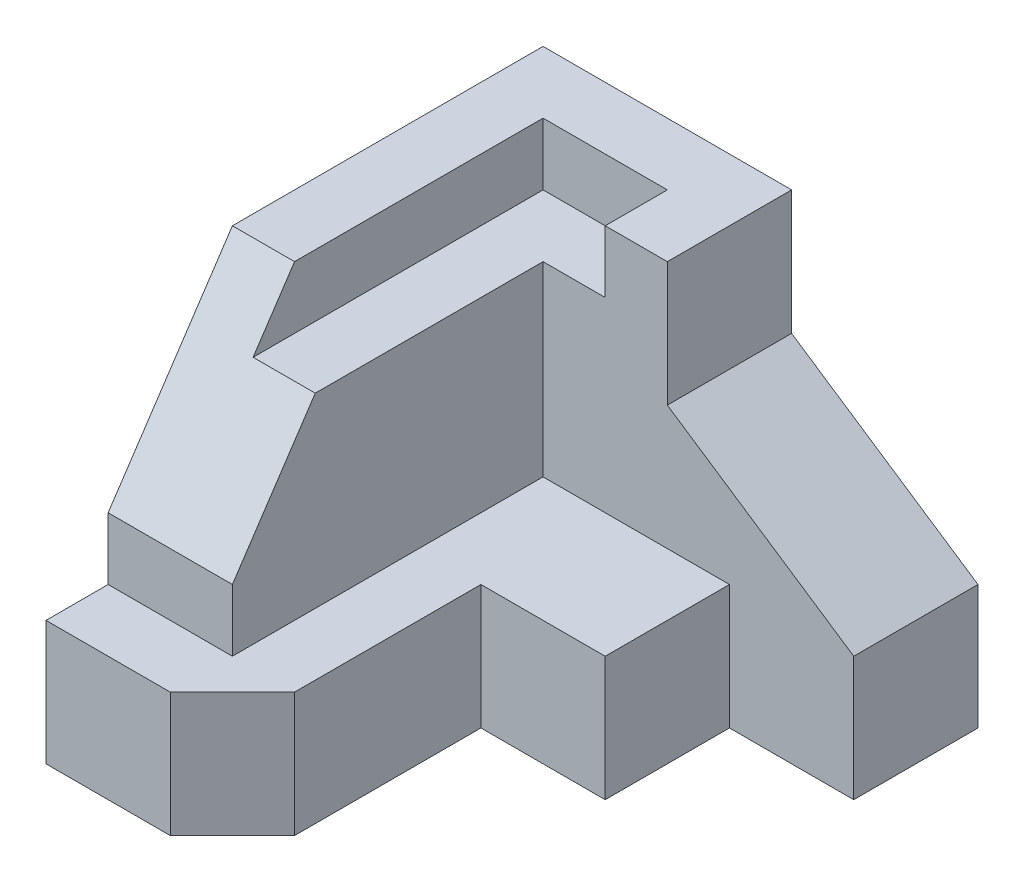
ISO-10303-21;
HEADER;
FILE_DESCRIPTION(('STEP AP214'),'2;1');
FILE_NAME('part.step','',(''),(''),'','','');
FILE_SCHEMA(('AUTOMOTIVE_DESIGN { 1 0 10303 214 1 1 1 1 }'));
ENDSEC;
DATA;
#1=APPLICATION_CONTEXT('core data for automotive mechanical design processes');
#2=APPLICATION_PROTOCOL_DEFINITION('international standard','automotive_design',2000,#1);
#3=PRODUCT_CONTEXT('',#1,'mechanical');
#4=PRODUCT('Part','Part','',(#3));
#5=PRODUCT_RELATED_PRODUCT_CATEGORY('part','',(#4));
#6=PRODUCT_DEFINITION_FORMATION('','',#4);
#7=PRODUCT_DEFINITION_CONTEXT('part definition',#1,'design');
#8=PRODUCT_DEFINITION('design','',#6,#7);
#9=PRODUCT_DEFINITION_SHAPE('','',#8);
#10=(LENGTH_UNIT() NAMED_UNIT(*) SI_UNIT(.MILLI.,.METRE.));
#11=(NAMED_UNIT(*) PLANE_ANGLE_UNIT() SI_UNIT($,.RADIAN.));
#12=(NAMED_UNIT(*) SI_UNIT($,.STERADIAN.) SOLID_ANGLE_UNIT());
#13=UNCERTAINTY_MEASURE_WITH_UNIT(LENGTH_MEASURE(1.E-05),#10,'distance_accuracy_value','');
#14=(GEOMETRIC_REPRESENTATION_CONTEXT(3) GLOBAL_UNCERTAINTY_ASSIGNED_CONTEXT((#13)) GLOBAL_UNIT_ASSIGNED_CONTEXT((#10,
#11,#12)) REPRESENTATION_CONTEXT('',''));
#15=CARTESIAN_POINT('',(0.,0.,0.));
#16=DIRECTION('',(0.,0.,1.));
#17=DIRECTION('',(1.,0.,0.));
#18=AXIS2_PLACEMENT_3D('',#15,#16,#17);
#19=CARTESIAN_POINT('',(0.,0.,8.));
#20=DIRECTION('',(0.,0.,1.));
#21=DIRECTION('',(1.,0.,0.));
#22=AXIS2_PLACEMENT_3D('',#19,#20,#21);
#23=PLANE('',#22);
#24=DIRECTION('',(0.,1.,0.));
#25=VECTOR('',#24,1.);
#26=CARTESIAN_POINT('',(-1.5,-3.,8.));
#27=LINE('',#26,#25);
#28=CARTESIAN_POINT('',(-1.5,-3.,8.));
#29=VERTEX_POINT('',#28);
#30=CARTESIAN_POINT('',(-1.5,-0.999999999999999,8.));
#31=VERTEX_POINT('',#30);
#32=EDGE_CURVE('E209',#29,#31,#27,.T.);
#33=ORIENTED_EDGE('',*,*,#32,.T.);
#34=DIRECTION('',(1.,0.,0.));
#35=VECTOR('',#34,1.);
#36=CARTESIAN_POINT('',(-3.5,-1.,8.));
#37=LINE('',#36,#35);
#38=CARTESIAN_POINT('',(-3.5,-1.,8.));
#39=VERTEX_POINT('',#38);
#40=EDGE_CURVE('E264',#39,#31,#37,.T.);
#41=ORIENTED_EDGE('',*,*,#40,.F.);
#42=DIRECTION('',(0.,-1.,0.));
#43=VECTOR('',#42,1.);
#44=CARTESIAN_POINT('',(-3.5,-3.,8.));
#45=LINE('',#44,#43);
#46=CARTESIAN_POINT('',(-3.5,-3.,8.));
#47=VERTEX_POINT('',#46);
#48=EDGE_CURVE('E191',#39,#47,#45,.T.);
#49=ORIENTED_EDGE('',*,*,#48,.T.);
#50=DIRECTION('',(1.,0.,0.));
#51=VECTOR('',#50,1.);
#52=CARTESIAN_POINT('',(3.5,-3.,8.));
#53=LINE('',#52,#51);
#54=EDGE_CURVE('E187',#47,#29,#53,.T.);
#55=ORIENTED_EDGE('',*,*,#54,.T.);
#56=EDGE_LOOP('',(#33,#41,#49,#55));
#57=FACE_BOUND('',#56,.T.);
#58=ADVANCED_FACE('F33',(#57),#23,.T.);
#59=CARTESIAN_POINT('',(-0.499999999999998,-3.,7.));
#60=DIRECTION('',(-0.707106781186547,0.,-0.707106781186548));
#61=DIRECTION('',(-0.707106781186548,0.,0.707106781186547));
#62=AXIS2_PLACEMENT_3D('',#59,#60,#61);
#63=PLANE('',#62);
#64=DIRECTION('',(0.707106781186548,0.,-0.707106781186547));
#65=VECTOR('',#64,1.);
#66=CARTESIAN_POINT('',(-1.5,-0.999999999999999,8.));
#67=LINE('',#66,#65);
#68=CARTESIAN_POINT('',(-0.499999999999998,-0.999999999999999,7.));
#69=VERTEX_POINT('',#68);
#70=EDGE_CURVE('E262',#31,#69,#67,.T.);
#71=ORIENTED_EDGE('',*,*,#70,.F.);
#72=ORIENTED_EDGE('',*,*,#32,.F.);
#73=DIRECTION('',(-0.707106781186548,0.,0.707106781186547));
#74=VECTOR('',#73,1.);
#75=CARTESIAN_POINT('',(-0.499999999999998,-3.,7.));
#76=LINE('',#75,#74);
#77=CARTESIAN_POINT('',(-0.499999999999998,-3.,7.));
#78=VERTEX_POINT('',#77);
#79=EDGE_CURVE('E227',#78,#29,#76,.T.);
#80=ORIENTED_EDGE('',*,*,#79,.F.);
#81=DIRECTION('',(0.,1.,0.));
#82=VECTOR('',#81,1.);
#83=CARTESIAN_POINT('',(-0.499999999999998,-3.,7.));
#84=LINE('',#83,#82);
#85=EDGE_CURVE('E214',#78,#69,#84,.T.);
#86=ORIENTED_EDGE('',*,*,#85,.T.);
#87=EDGE_LOOP('',(#71,#72,#80,#86));
#88=FACE_BOUND('',#87,.T.);
#89=ADVANCED_FACE('F364',(#88),#63,.F.);
#90=CARTESIAN_POINT('',(-0.499999999999999,-3.,4.));
#91=DIRECTION('',(-1.,0.,0.));
#92=DIRECTION('',(0.,-1.,0.));
#93=AXIS2_PLACEMENT_3D('',#90,#91,#92);
#94=PLANE('',#93);
#95=DIRECTION('',(0.,0.,-1.));
#96=VECTOR('',#95,1.);
#97=CARTESIAN_POINT('',(-0.499999999999998,-0.999999999999999,7.));
#98=LINE('',#97,#96);
#99=CARTESIAN_POINT('',(-0.499999999999999,-0.999999999999999,4.));
#100=VERTEX_POINT('',#99);
#101=EDGE_CURVE('E257',#69,#100,#98,.T.);
#102=ORIENTED_EDGE('',*,*,#101,.F.);
#103=ORIENTED_EDGE('',*,*,#85,.F.);
#104=DIRECTION('',(0.,0.,1.));
#105=VECTOR('',#104,1.);
#106=CARTESIAN_POINT('',(-0.499999999999999,-3.,4.));
#107=LINE('',#106,#105);
#108=CARTESIAN_POINT('',(-0.499999999999999,-3.,4.));
#109=VERTEX_POINT('',#108);
#110=EDGE_CURVE('E243',#109,#78,#107,.T.);
#111=ORIENTED_EDGE('',*,*,#110,.F.);
#112=DIRECTION('',(0.,1.,0.));
#113=VECTOR('',#112,1.);
#114=CARTESIAN_POINT('',(-0.499999999999999,-3.,4.));
#115=LINE('',#114,#113);
#116=EDGE_CURVE('E233',#109,#100,#115,.T.);
#117=ORIENTED_EDGE('',*,*,#116,.T.);
#118=EDGE_LOOP('',(#102,#103,#111,#117));
#119=FACE_BOUND('',#118,.T.);
#120=ADVANCED_FACE('F369',(#119),#94,.F.);
#121=CARTESIAN_POINT('',(1.5,-3.,4.));
#122=DIRECTION('',(0.,0.,-1.));
#123=DIRECTION('',(-1.,0.,0.));
#124=AXIS2_PLACEMENT_3D('',#121,#122,#123);
#125=PLANE('',#124);
#126=DIRECTION('',(1.,0.,0.));
#127=VECTOR('',#126,1.);
#128=CARTESIAN_POINT('',(-0.499999999999999,-0.999999999999999,4.));
#129=LINE('',#128,#127);
#130=CARTESIAN_POINT('',(1.5,-0.999999999999999,4.));
#131=VERTEX_POINT('',#130);
#132=EDGE_CURVE('E279',#100,#131,#129,.T.);
#133=ORIENTED_EDGE('',*,*,#132,.F.);
#134=ORIENTED_EDGE('',*,*,#116,.F.);
#135=DIRECTION('',(-1.,0.,0.));
#136=VECTOR('',#135,1.);
#137=CARTESIAN_POINT('',(1.5,-3.,4.));
#138=LINE('',#137,#136);
#139=CARTESIAN_POINT('',(1.5,-3.,4.));
#140=VERTEX_POINT('',#139);
#141=EDGE_CURVE('E245',#140,#109,#138,.T.);
#142=ORIENTED_EDGE('',*,*,#141,.F.);
#143=DIRECTION('',(0.,1.,0.));
#144=VECTOR('',#143,1.);
#145=CARTESIAN_POINT('',(1.5,-3.,4.));
#146=LINE('',#145,#144);
#147=EDGE_CURVE('E230',#140,#131,#146,.T.);
#148=ORIENTED_EDGE('',*,*,#147,.T.);
#149=EDGE_LOOP('',(#133,#134,#142,#148));
#150=FACE_BOUND('',#149,.T.);
#151=ADVANCED_FACE('F390',(#150),#125,.F.);
#152=CARTESIAN_POINT('',(1.5,-3.,2.));
#153=DIRECTION('',(-1.,0.,0.));
#154=DIRECTION('',(0.,-1.,0.));
#155=AXIS2_PLACEMENT_3D('',#152,#153,#154);
#156=PLANE('',#155);
#157=DIRECTION('',(0.,0.,-1.));
#158=VECTOR('',#157,1.);
#159=CARTESIAN_POINT('',(1.5,-0.999999999999999,4.));
#160=LINE('',#159,#158);
#161=CARTESIAN_POINT('',(1.5,-1.,2.));
#162=VERTEX_POINT('',#161);
#163=EDGE_CURVE('E277',#131,#162,#160,.T.);
#164=ORIENTED_EDGE('',*,*,#163,.F.);
#165=ORIENTED_EDGE('',*,*,#147,.F.);
#166=DIRECTION('',(0.,0.,1.));
#167=VECTOR('',#166,1.);
#168=CARTESIAN_POINT('',(1.5,-3.,2.));
#169=LINE('',#168,#167);
#170=CARTESIAN_POINT('',(1.5,-3.,2.));
#171=VERTEX_POINT('',#170);
#172=EDGE_CURVE('E248',#171,#140,#169,.T.);
#173=ORIENTED_EDGE('',*,*,#172,.F.);
#174=DIRECTION('',(0.,1.,0.));
#175=VECTOR('',#174,1.);
#176=CARTESIAN_POINT('',(1.5,-3.,2.));
#177=LINE('',#176,#175);
#178=EDGE_CURVE('E226',#171,#162,#177,.T.);
#179=ORIENTED_EDGE('',*,*,#178,.T.);
#180=EDGE_LOOP('',(#164,#165,#173,#179));
#181=FACE_BOUND('',#180,.T.);
#182=ADVANCED_FACE('F386',(#181),#156,.F.);
#183=CARTESIAN_POINT('',(-3.5,-3.,8.));
#184=DIRECTION('',(1.,0.,0.));
#185=DIRECTION('',(0.,0.,-1.));
#186=AXIS2_PLACEMENT_3D('',#183,#184,#185);
#187=PLANE('',#186);
#188=DIRECTION('',(0.,1.,0.));
#189=VECTOR('',#188,1.);
#190=CARTESIAN_POINT('',(-3.5,-1.,7.));
#191=LINE('',#190,#189);
#192=CARTESIAN_POINT('',(-3.5,-1.,7.));
#193=VERTEX_POINT('',#192);
#194=CARTESIAN_POINT('',(-3.5,0.,7.));
#195=VERTEX_POINT('',#194);
#196=EDGE_CURVE('E179',#193,#195,#191,.T.);
#197=ORIENTED_EDGE('',*,*,#196,.T.);
#198=DIRECTION('',(0.,0.832050294337844,-0.554700196225229));
#199=VECTOR('',#198,1.);
#200=CARTESIAN_POINT('',(-3.5,0.,7.));
#201=LINE('',#200,#199);
#202=CARTESIAN_POINT('',(-3.5,3.,5.));
#203=VERTEX_POINT('',#202);
#204=EDGE_CURVE('E164',#195,#203,#201,.T.);
#205=ORIENTED_EDGE('',*,*,#204,.T.);
#206=DIRECTION('',(0.,0.,-1.));
#207=VECTOR('',#206,1.);
#208=CARTESIAN_POINT('',(-3.5,3.,8.));
#209=LINE('',#208,#207);
#210=CARTESIAN_POINT('',(-3.5,3.,0.));
#211=VERTEX_POINT('',#210);
#212=EDGE_CURVE('E176',#203,#211,#209,.T.);
#213=ORIENTED_EDGE('',*,*,#212,.T.);
#214=DIRECTION('',(0.,-1.,0.));
#215=VECTOR('',#214,1.);
#216=CARTESIAN_POINT('',(-3.5,-3.,0.));
#217=LINE('',#216,#215);
#218=CARTESIAN_POINT('',(-3.5,-3.,0.));
#219=VERTEX_POINT('',#218);
#220=EDGE_CURVE('E207',#211,#219,#217,.T.);
#221=ORIENTED_EDGE('',*,*,#220,.T.);
#222=DIRECTION('',(0.,0.,-1.));
#223=VECTOR('',#222,1.);
#224=CARTESIAN_POINT('',(-3.5,-3.,8.));
#225=LINE('',#224,#223);
#226=EDGE_CURVE('E41',#47,#219,#225,.T.);
#227=ORIENTED_EDGE('',*,*,#226,.F.);
#228=ORIENTED_EDGE('',*,*,#48,.F.);
#229=DIRECTION('',(0.,0.,1.));
#230=VECTOR('',#229,1.);
#231=CARTESIAN_POINT('',(-3.5,-1.,7.));
#232=LINE('',#231,#230);
#233=EDGE_CURVE('E266',#193,#39,#232,.T.);
#234=ORIENTED_EDGE('',*,*,#233,.F.);
#235=EDGE_LOOP('',(#197,#205,#213,#221,#227,#228,#234));
#236=FACE_BOUND('',#235,.T.);
#237=ADVANCED_FACE('F35',(#236),#187,.F.);
#238=CARTESIAN_POINT('',(3.5,-3.,8.));
#239=DIRECTION('',(0.,1.,0.));
#240=DIRECTION('',(-1.,0.,0.));
#241=AXIS2_PLACEMENT_3D('',#238,#239,#240);
#242=PLANE('',#241);
#243=ORIENTED_EDGE('',*,*,#110,.T.);
#244=ORIENTED_EDGE('',*,*,#79,.T.);
#245=ORIENTED_EDGE('',*,*,#54,.F.);
#246=ORIENTED_EDGE('',*,*,#226,.T.);
#247=DIRECTION('',(1.,0.,0.));
#248=VECTOR('',#247,1.);
#249=CARTESIAN_POINT('',(3.5,-3.,0.));
#250=LINE('',#249,#248);
#251=CARTESIAN_POINT('',(3.5,-3.,0.));
#252=VERTEX_POINT('',#251);
#253=EDGE_CURVE('E203',#219,#252,#250,.T.);
#254=ORIENTED_EDGE('',*,*,#253,.T.);
#255=DIRECTION('',(0.,0.,-1.));
#256=VECTOR('',#255,1.);
#257=CARTESIAN_POINT('',(3.5,-3.,8.));
#258=LINE('',#257,#256);
#259=CARTESIAN_POINT('',(3.5,-3.,2.));
#260=VERTEX_POINT('',#259);
#261=EDGE_CURVE('E186',#260,#252,#258,.T.);
#262=ORIENTED_EDGE('',*,*,#261,.F.);
#263=DIRECTION('',(-1.,0.,0.));
#264=VECTOR('',#263,1.);
#265=CARTESIAN_POINT('',(3.5,-3.,2.));
#266=LINE('',#265,#264);
#267=EDGE_CURVE('E241',#260,#171,#266,.T.);
#268=ORIENTED_EDGE('',*,*,#267,.T.);
#269=ORIENTED_EDGE('',*,*,#172,.T.);
#270=ORIENTED_EDGE('',*,*,#141,.T.);
#271=EDGE_LOOP('',(#243,#244,#245,#246,#254,#262,#268,#269,#270));
#272=FACE_BOUND('',#271,.T.);
#273=ADVANCED_FACE('F201',(#272),#242,.F.);
#274=CARTESIAN_POINT('',(3.5,-3.,8.));
#275=DIRECTION('',(-1.,0.,0.));
#276=DIRECTION('',(0.,0.,1.));
#277=AXIS2_PLACEMENT_3D('',#274,#275,#276);
#278=PLANE('',#277);
#279=DIRECTION('',(0.,1.,0.));
#280=VECTOR('',#279,1.);
#281=CARTESIAN_POINT('',(3.5,-3.,0.));
#282=LINE('',#281,#280);
#283=CARTESIAN_POINT('',(3.5,-0.999999999999999,0.));
#284=VERTEX_POINT('',#283);
#285=EDGE_CURVE('E211',#252,#284,#282,.T.);
#286=ORIENTED_EDGE('',*,*,#285,.T.);
#287=DIRECTION('',(0.,0.,-1.));
#288=VECTOR('',#287,1.);
#289=CARTESIAN_POINT('',(3.5,-0.999999999999999,2.));
#290=LINE('',#289,#288);
#291=CARTESIAN_POINT('',(3.5,-0.999999999999999,2.));
#292=VERTEX_POINT('',#291);
#293=EDGE_CURVE('E282',#292,#284,#290,.T.);
#294=ORIENTED_EDGE('',*,*,#293,.F.);
#295=DIRECTION('',(0.,1.,0.));
#296=VECTOR('',#295,1.);
#297=CARTESIAN_POINT('',(3.5,-3.,2.));
#298=LINE('',#297,#296);
#299=EDGE_CURVE('E223',#260,#292,#298,.T.);
#300=ORIENTED_EDGE('',*,*,#299,.F.);
#301=ORIENTED_EDGE('',*,*,#261,.T.);
#302=EDGE_LOOP('',(#286,#294,#300,#301));
#303=FACE_BOUND('',#302,.T.);
#304=ADVANCED_FACE('F380',(#303),#278,.F.);
#305=CARTESIAN_POINT('',(3.5,3.,8.));
#306=DIRECTION('',(0.,-1.,0.));
#307=DIRECTION('',(1.,0.,0.));
#308=AXIS2_PLACEMENT_3D('',#305,#306,#307);
#309=PLANE('',#308);
#310=ORIENTED_EDGE('',*,*,#212,.F.);
#311=DIRECTION('',(1.,0.,0.));
#312=VECTOR('',#311,1.);
#313=CARTESIAN_POINT('',(-3.5,3.,5.));
#314=LINE('',#313,#312);
#315=CARTESIAN_POINT('',(-2.5,3.,5.));
#316=VERTEX_POINT('',#315);
#317=EDGE_CURVE('E161',#203,#316,#314,.T.);
#318=ORIENTED_EDGE('',*,*,#317,.T.);
#319=DIRECTION('',(0.,0.,1.));
#320=VECTOR('',#319,1.);
#321=CARTESIAN_POINT('',(-2.5,3.,1.));
#322=LINE('',#321,#320);
#323=CARTESIAN_POINT('',(-2.5,3.,1.));
#324=VERTEX_POINT('',#323);
#325=EDGE_CURVE('E303',#324,#316,#322,.T.);
#326=ORIENTED_EDGE('',*,*,#325,.F.);
#327=DIRECTION('',(-1.,0.,0.));
#328=VECTOR('',#327,1.);
#329=CARTESIAN_POINT('',(-0.5,3.,1.));
#330=LINE('',#329,#328);
#331=CARTESIAN_POINT('',(-0.5,3.,1.));
#332=VERTEX_POINT('',#331);
#333=EDGE_CURVE('E306',#332,#324,#330,.T.);
#334=ORIENTED_EDGE('',*,*,#333,.F.);
#335=DIRECTION('',(0.,0.,-1.));
#336=VECTOR('',#335,1.);
#337=CARTESIAN_POINT('',(-0.5,3.,2.));
#338=LINE('',#337,#336);
#339=CARTESIAN_POINT('',(-0.5,3.,2.));
#340=VERTEX_POINT('',#339);
#341=EDGE_CURVE('E309',#340,#332,#338,.T.);
#342=ORIENTED_EDGE('',*,*,#341,.F.);
#343=DIRECTION('',(-1.,0.,0.));
#344=VECTOR('',#343,1.);
#345=CARTESIAN_POINT('',(3.5,3.,2.));
#346=LINE('',#345,#344);
#347=CARTESIAN_POINT('',(0.5,3.,2.));
#348=VERTEX_POINT('',#347);
#349=EDGE_CURVE('E238',#348,#340,#346,.T.);
#350=ORIENTED_EDGE('',*,*,#349,.F.);
#351=DIRECTION('',(0.,0.,-1.));
#352=VECTOR('',#351,1.);
#353=CARTESIAN_POINT('',(0.5,3.,2.));
#354=LINE('',#353,#352);
#355=CARTESIAN_POINT('',(0.5,3.,0.));
#356=VERTEX_POINT('',#355);
#357=EDGE_CURVE('E281',#348,#356,#354,.T.);
#358=ORIENTED_EDGE('',*,*,#357,.T.);
#359=DIRECTION('',(-1.,0.,0.));
#360=VECTOR('',#359,1.);
#361=CARTESIAN_POINT('',(3.5,3.,0.));
#362=LINE('',#361,#360);
#363=EDGE_CURVE('E184',#356,#211,#362,.T.);
#364=ORIENTED_EDGE('',*,*,#363,.T.);
#365=EDGE_LOOP('',(#310,#318,#326,#334,#342,#350,#358,#364));
#366=FACE_BOUND('',#365,.T.);
#367=ADVANCED_FACE('F181',(#366),#309,.F.);
#368=CARTESIAN_POINT('',(0.,0.,0.));
#369=DIRECTION('',(0.,0.,1.));
#370=DIRECTION('',(1.,0.,0.));
#371=AXIS2_PLACEMENT_3D('',#368,#369,#370);
#372=PLANE('',#371);
#373=ORIENTED_EDGE('',*,*,#363,.F.);
#374=DIRECTION('',(0.,1.,0.));
#375=VECTOR('',#374,1.);
#376=CARTESIAN_POINT('',(0.5,1.,0.));
#377=LINE('',#376,#375);
#378=CARTESIAN_POINT('',(0.5,1.,0.));
#379=VERTEX_POINT('',#378);
#380=EDGE_CURVE('E287',#379,#356,#377,.T.);
#381=ORIENTED_EDGE('',*,*,#380,.F.);
#382=DIRECTION('',(-0.832050294337844,0.554700196225229,0.));
#383=VECTOR('',#382,1.);
#384=CARTESIAN_POINT('',(3.5,-0.999999999999999,0.));
#385=LINE('',#384,#383);
#386=EDGE_CURVE('E290',#284,#379,#385,.T.);
#387=ORIENTED_EDGE('',*,*,#386,.F.);
#388=ORIENTED_EDGE('',*,*,#285,.F.);
#389=ORIENTED_EDGE('',*,*,#253,.F.);
#390=ORIENTED_EDGE('',*,*,#220,.F.);
#391=EDGE_LOOP('',(#373,#381,#387,#388,#389,#390));
#392=FACE_BOUND('',#391,.T.);
#393=ADVANCED_FACE('F375',(#392),#372,.F.);
#394=CARTESIAN_POINT('',(3.5,-3.,2.));
#395=DIRECTION('',(0.,0.,-1.));
#396=DIRECTION('',(-1.,0.,0.));
#397=AXIS2_PLACEMENT_3D('',#394,#395,#396);
#398=PLANE('',#397);
#399=ORIENTED_EDGE('',*,*,#349,.T.);
#400=DIRECTION('',(0.,1.,0.));
#401=VECTOR('',#400,1.);
#402=CARTESIAN_POINT('',(-0.499999999999999,2.,2.));
#403=LINE('',#402,#401);
#404=CARTESIAN_POINT('',(-0.499999999999999,2.,2.));
#405=VERTEX_POINT('',#404);
#406=EDGE_CURVE('E297',#405,#340,#403,.T.);
#407=ORIENTED_EDGE('',*,*,#406,.F.);
#408=DIRECTION('',(1.,0.,0.));
#409=VECTOR('',#408,1.);
#410=CARTESIAN_POINT('',(-1.5,2.,2.));
#411=LINE('',#410,#409);
#412=CARTESIAN_POINT('',(-1.5,2.,2.));
#413=VERTEX_POINT('',#412);
#414=EDGE_CURVE('E305',#413,#405,#411,.T.);
#415=ORIENTED_EDGE('',*,*,#414,.F.);
#416=DIRECTION('',(0.,1.,0.));
#417=VECTOR('',#416,1.);
#418=CARTESIAN_POINT('',(-1.5,-0.999999999999999,2.));
#419=LINE('',#418,#417);
#420=CARTESIAN_POINT('',(-1.5,-0.999999999999999,2.));
#421=VERTEX_POINT('',#420);
#422=EDGE_CURVE('E253',#421,#413,#419,.T.);
#423=ORIENTED_EDGE('',*,*,#422,.F.);
#424=DIRECTION('',(-1.,0.,0.));
#425=VECTOR('',#424,1.);
#426=CARTESIAN_POINT('',(1.5,-0.999999999999999,2.));
#427=LINE('',#426,#425);
#428=EDGE_CURVE('E274',#162,#421,#427,.T.);
#429=ORIENTED_EDGE('',*,*,#428,.F.);
#430=ORIENTED_EDGE('',*,*,#178,.F.);
#431=ORIENTED_EDGE('',*,*,#267,.F.);
#432=ORIENTED_EDGE('',*,*,#299,.T.);
#433=DIRECTION('',(-0.832050294337844,0.554700196225229,0.));
#434=VECTOR('',#433,1.);
#435=CARTESIAN_POINT('',(3.5,-0.999999999999999,2.));
#436=LINE('',#435,#434);
#437=CARTESIAN_POINT('',(0.5,1.,2.));
#438=VERTEX_POINT('',#437);
#439=EDGE_CURVE('E289',#292,#438,#436,.T.);
#440=ORIENTED_EDGE('',*,*,#439,.T.);
#441=DIRECTION('',(0.,1.,0.));
#442=VECTOR('',#441,1.);
#443=CARTESIAN_POINT('',(0.5,1.,2.));
#444=LINE('',#443,#442);
#445=EDGE_CURVE('E55',#438,#348,#444,.T.);
#446=ORIENTED_EDGE('',*,*,#445,.T.);
#447=EDGE_LOOP('',(#399,#407,#415,#423,#429,#430,#431,#432,#440,#446));
#448=FACE_BOUND('',#447,.T.);
#449=ADVANCED_FACE('F339',(#448),#398,.F.);
#450=CARTESIAN_POINT('',(-1.5,-0.999999999999999,7.));
#451=DIRECTION('',(0.,0.,-1.));
#452=DIRECTION('',(-1.,0.,0.));
#453=AXIS2_PLACEMENT_3D('',#450,#451,#452);
#454=PLANE('',#453);
#455=DIRECTION('',(0.,1.,0.));
#456=VECTOR('',#455,1.);
#457=CARTESIAN_POINT('',(-1.5,-0.999999999999999,7.));
#458=LINE('',#457,#456);
#459=CARTESIAN_POINT('',(-1.5,-0.999999999999999,7.));
#460=VERTEX_POINT('',#459);
#461=CARTESIAN_POINT('',(-1.5,0.,7.));
#462=VERTEX_POINT('',#461);
#463=EDGE_CURVE('E256',#460,#462,#458,.T.);
#464=ORIENTED_EDGE('',*,*,#463,.T.);
#465=DIRECTION('',(-1.,0.,0.));
#466=VECTOR('',#465,1.);
#467=CARTESIAN_POINT('',(-1.5,0.,7.));
#468=LINE('',#467,#466);
#469=EDGE_CURVE('E325',#462,#195,#468,.T.);
#470=ORIENTED_EDGE('',*,*,#469,.T.);
#471=ORIENTED_EDGE('',*,*,#196,.F.);
#472=DIRECTION('',(-1.,0.,0.));
#473=VECTOR('',#472,1.);
#474=CARTESIAN_POINT('',(-1.5,-0.999999999999999,7.));
#475=LINE('',#474,#473);
#476=EDGE_CURVE('E268',#460,#193,#475,.T.);
#477=ORIENTED_EDGE('',*,*,#476,.F.);
#478=EDGE_LOOP('',(#464,#470,#471,#477));
#479=FACE_BOUND('',#478,.T.);
#480=ADVANCED_FACE('F333',(#479),#454,.F.);
#481=CARTESIAN_POINT('',(-1.5,-0.999999999999999,2.));
#482=DIRECTION('',(-1.,0.,0.));
#483=DIRECTION('',(0.,0.,1.));
#484=AXIS2_PLACEMENT_3D('',#481,#482,#483);
#485=PLANE('',#484);
#486=DIRECTION('',(0.,0.,-1.));
#487=VECTOR('',#486,1.);
#488=CARTESIAN_POINT('',(-1.5,2.,6.));
#489=LINE('',#488,#487);
#490=CARTESIAN_POINT('',(-1.5,2.,5.66666666666667));
#491=VERTEX_POINT('',#490);
#492=EDGE_CURVE('E300',#491,#413,#489,.T.);
#493=ORIENTED_EDGE('',*,*,#492,.F.);
#494=DIRECTION('',(0.,-0.832050294337844,0.554700196225229));
#495=VECTOR('',#494,1.);
#496=CARTESIAN_POINT('',(-1.5,3.,5.));
#497=LINE('',#496,#495);
#498=EDGE_CURVE('E47',#491,#462,#497,.T.);
#499=ORIENTED_EDGE('',*,*,#498,.T.);
#500=ORIENTED_EDGE('',*,*,#463,.F.);
#501=DIRECTION('',(0.,0.,1.));
#502=VECTOR('',#501,1.);
#503=CARTESIAN_POINT('',(-1.5,-0.999999999999999,2.));
#504=LINE('',#503,#502);
#505=EDGE_CURVE('E271',#421,#460,#504,.T.);
#506=ORIENTED_EDGE('',*,*,#505,.F.);
#507=ORIENTED_EDGE('',*,*,#422,.T.);
#508=EDGE_LOOP('',(#493,#499,#500,#506,#507));
#509=FACE_BOUND('',#508,.T.);
#510=ADVANCED_FACE('F329',(#509),#485,.F.);
#511=CARTESIAN_POINT('',(0.,-0.999999999999999,0.));
#512=DIRECTION('',(0.,1.,0.));
#513=DIRECTION('',(0.,0.,1.));
#514=AXIS2_PLACEMENT_3D('',#511,#512,#513);
#515=PLANE('',#514);
#516=ORIENTED_EDGE('',*,*,#132,.T.);
#517=ORIENTED_EDGE('',*,*,#163,.T.);
#518=ORIENTED_EDGE('',*,*,#428,.T.);
#519=ORIENTED_EDGE('',*,*,#505,.T.);
#520=ORIENTED_EDGE('',*,*,#476,.T.);
#521=ORIENTED_EDGE('',*,*,#233,.T.);
#522=ORIENTED_EDGE('',*,*,#40,.T.);
#523=ORIENTED_EDGE('',*,*,#70,.T.);
#524=ORIENTED_EDGE('',*,*,#101,.T.);
#525=EDGE_LOOP('',(#516,#517,#518,#519,#520,#521,#522,#523,#524));
#526=FACE_BOUND('',#525,.T.);
#527=ADVANCED_FACE('F335',(#526),#515,.T.);
#528=CARTESIAN_POINT('',(0.5,1.,2.));
#529=DIRECTION('',(-1.,0.,0.));
#530=DIRECTION('',(0.,0.,1.));
#531=AXIS2_PLACEMENT_3D('',#528,#529,#530);
#532=PLANE('',#531);
#533=ORIENTED_EDGE('',*,*,#380,.T.);
#534=ORIENTED_EDGE('',*,*,#357,.F.);
#535=ORIENTED_EDGE('',*,*,#445,.F.);
#536=DIRECTION('',(0.,0.,-1.));
#537=VECTOR('',#536,1.);
#538=CARTESIAN_POINT('',(0.5,1.,2.));
#539=LINE('',#538,#537);
#540=EDGE_CURVE('E284',#438,#379,#539,.T.);
#541=ORIENTED_EDGE('',*,*,#540,.T.);
#542=EDGE_LOOP('',(#533,#534,#535,#541));
#543=FACE_BOUND('',#542,.T.);
#544=ADVANCED_FACE('F408',(#543),#532,.F.);
#545=CARTESIAN_POINT('',(3.5,-0.999999999999999,2.));
#546=DIRECTION('',(-0.554700196225229,-0.832050294337844,0.));
#547=DIRECTION('',(0.832050294337844,-0.554700196225229,0.));
#548=AXIS2_PLACEMENT_3D('',#545,#546,#547);
#549=PLANE('',#548);
#550=ORIENTED_EDGE('',*,*,#386,.T.);
#551=ORIENTED_EDGE('',*,*,#540,.F.);
#552=ORIENTED_EDGE('',*,*,#439,.F.);
#553=ORIENTED_EDGE('',*,*,#293,.T.);
#554=EDGE_LOOP('',(#550,#551,#552,#553));
#555=FACE_BOUND('',#554,.T.);
#556=ADVANCED_FACE('F409',(#555),#549,.F.);
#557=CARTESIAN_POINT('',(-2.5,2.,1.));
#558=DIRECTION('',(-1.,0.,0.));
#559=DIRECTION('',(0.,-1.,0.));
#560=AXIS2_PLACEMENT_3D('',#557,#558,#559);
#561=PLANE('',#560);
#562=ORIENTED_EDGE('',*,*,#325,.T.);
#563=DIRECTION('',(0.,-0.832050294337844,0.554700196225229));
#564=VECTOR('',#563,1.);
#565=CARTESIAN_POINT('',(-2.5,4.15384615384615,4.23076923076923));
#566=LINE('',#565,#564);
#567=CARTESIAN_POINT('',(-2.5,2.,5.66666666666667));
#568=VERTEX_POINT('',#567);
#569=EDGE_CURVE('E167',#316,#568,#566,.T.);
#570=ORIENTED_EDGE('',*,*,#569,.T.);
#571=DIRECTION('',(0.,0.,1.));
#572=VECTOR('',#571,1.);
#573=CARTESIAN_POINT('',(-2.5,2.,1.));
#574=LINE('',#573,#572);
#575=CARTESIAN_POINT('',(-2.5,2.,1.));
#576=VERTEX_POINT('',#575);
#577=EDGE_CURVE('E313',#576,#568,#574,.T.);
#578=ORIENTED_EDGE('',*,*,#577,.F.);
#579=DIRECTION('',(0.,1.,0.));
#580=VECTOR('',#579,1.);
#581=CARTESIAN_POINT('',(-2.5,2.,1.));
#582=LINE('',#581,#580);
#583=EDGE_CURVE('E293',#576,#324,#582,.T.);
#584=ORIENTED_EDGE('',*,*,#583,.T.);
#585=EDGE_LOOP('',(#562,#570,#578,#584));
#586=FACE_BOUND('',#585,.T.);
#587=ADVANCED_FACE('F345',(#586),#561,.F.);
#588=CARTESIAN_POINT('',(-0.499999999999999,2.,1.));
#589=DIRECTION('',(0.,0.,-1.));
#590=DIRECTION('',(-1.,0.,0.));
#591=AXIS2_PLACEMENT_3D('',#588,#589,#590);
#592=PLANE('',#591);
#593=ORIENTED_EDGE('',*,*,#333,.T.);
#594=ORIENTED_EDGE('',*,*,#583,.F.);
#595=DIRECTION('',(-1.,0.,0.));
#596=VECTOR('',#595,1.);
#597=CARTESIAN_POINT('',(-0.499999999999999,2.,1.));
#598=LINE('',#597,#596);
#599=CARTESIAN_POINT('',(-0.499999999999999,2.,1.));
#600=VERTEX_POINT('',#599);
#601=EDGE_CURVE('E316',#600,#576,#598,.T.);
#602=ORIENTED_EDGE('',*,*,#601,.F.);
#603=DIRECTION('',(0.,1.,0.));
#604=VECTOR('',#603,1.);
#605=CARTESIAN_POINT('',(-0.499999999999999,2.,1.));
#606=LINE('',#605,#604);
#607=EDGE_CURVE('E299',#600,#332,#606,.T.);
#608=ORIENTED_EDGE('',*,*,#607,.T.);
#609=EDGE_LOOP('',(#593,#594,#602,#608));
#610=FACE_BOUND('',#609,.T.);
#611=ADVANCED_FACE('F350',(#610),#592,.F.);
#612=CARTESIAN_POINT('',(-0.499999999999999,2.,2.));
#613=DIRECTION('',(1.,0.,0.));
#614=DIRECTION('',(0.,1.,0.));
#615=AXIS2_PLACEMENT_3D('',#612,#613,#614);
#616=PLANE('',#615);
#617=ORIENTED_EDGE('',*,*,#341,.T.);
#618=ORIENTED_EDGE('',*,*,#607,.F.);
#619=DIRECTION('',(0.,0.,-1.));
#620=VECTOR('',#619,1.);
#621=CARTESIAN_POINT('',(-0.499999999999999,2.,2.));
#622=LINE('',#621,#620);
#623=EDGE_CURVE('E319',#405,#600,#622,.T.);
#624=ORIENTED_EDGE('',*,*,#623,.F.);
#625=ORIENTED_EDGE('',*,*,#406,.T.);
#626=EDGE_LOOP('',(#617,#618,#624,#625));
#627=FACE_BOUND('',#626,.T.);
#628=ADVANCED_FACE('F353',(#627),#616,.F.);
#629=CARTESIAN_POINT('',(0.,2.,0.));
#630=DIRECTION('',(0.,1.,0.));
#631=DIRECTION('',(0.,0.,1.));
#632=AXIS2_PLACEMENT_3D('',#629,#630,#631);
#633=PLANE('',#632);
#634=DIRECTION('',(-1.,0.,0.));
#635=VECTOR('',#634,1.);
#636=CARTESIAN_POINT('',(0.,2.,5.66666666666667));
#637=LINE('',#636,#635);
#638=EDGE_CURVE('E11',#491,#568,#637,.T.);
#639=ORIENTED_EDGE('',*,*,#638,.F.);
#640=ORIENTED_EDGE('',*,*,#492,.T.);
#641=ORIENTED_EDGE('',*,*,#414,.T.);
#642=ORIENTED_EDGE('',*,*,#623,.T.);
#643=ORIENTED_EDGE('',*,*,#601,.T.);
#644=ORIENTED_EDGE('',*,*,#577,.T.);
#645=EDGE_LOOP('',(#639,#640,#641,#642,#643,#644));
#646=FACE_BOUND('',#645,.T.);
#647=ADVANCED_FACE('F342',(#646),#633,.T.);
#648=CARTESIAN_POINT('',(0.,3.23076923076923,4.84615384615385));
#649=DIRECTION('',(0.,-0.554700196225229,-0.832050294337844));
#650=DIRECTION('',(0.,0.832050294337844,-0.554700196225229));
#651=AXIS2_PLACEMENT_3D('',#648,#649,#650);
#652=PLANE('',#651);
#653=ORIENTED_EDGE('',*,*,#317,.F.);
#654=ORIENTED_EDGE('',*,*,#204,.F.);
#655=ORIENTED_EDGE('',*,*,#469,.F.);
#656=ORIENTED_EDGE('',*,*,#498,.F.);
#657=ORIENTED_EDGE('',*,*,#638,.T.);
#658=ORIENTED_EDGE('',*,*,#569,.F.);
#659=EDGE_LOOP('',(#653,#654,#655,#656,#657,#658));
#660=FACE_BOUND('',#659,.T.);
#661=ADVANCED_FACE('F163',(#660),#652,.F.);
#662=CLOSED_SHELL('',(#58,#89,#120,#151,#182,#237,#273,#304,#367,#393,#449,#480,#510,#527,#544,
#556,#587,#611,#628,#647,#661));
#663=MANIFOLD_SOLID_BREP('B2',#662);
#664=ADVANCED_BREP_SHAPE_REPRESENTATION('',(#18,#663),#14);
#665=SHAPE_DEFINITION_REPRESENTATION(#9,#664);
ENDSEC;
END-ISO-10303-21;
